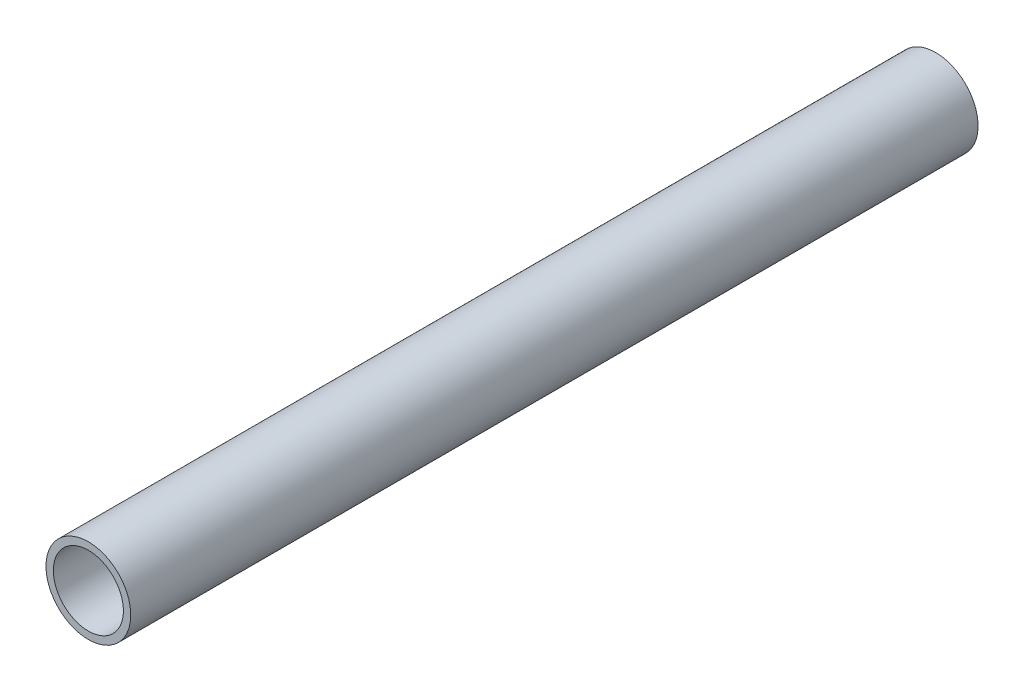
ISO-10303-21;
HEADER;
FILE_DESCRIPTION(('STEP AP214'),'2;1');
FILE_NAME('part.step','',(''),(''),'','','');
FILE_SCHEMA(('AUTOMOTIVE_DESIGN { 1 0 10303 214 1 1 1 1 }'));
ENDSEC;
DATA;
#1=APPLICATION_CONTEXT('core data for automotive mechanical design processes');
#2=APPLICATION_PROTOCOL_DEFINITION('international standard','automotive_design',2000,#1);
#3=PRODUCT_CONTEXT('',#1,'mechanical');
#4=PRODUCT('Part','Part','',(#3));
#5=PRODUCT_RELATED_PRODUCT_CATEGORY('part','',(#4));
#6=PRODUCT_DEFINITION_FORMATION('','',#4);
#7=PRODUCT_DEFINITION_CONTEXT('part definition',#1,'design');
#8=PRODUCT_DEFINITION('design','',#6,#7);
#9=PRODUCT_DEFINITION_SHAPE('','',#8);
#10=(LENGTH_UNIT() NAMED_UNIT(*) SI_UNIT(.MILLI.,.METRE.));
#11=(NAMED_UNIT(*) PLANE_ANGLE_UNIT() SI_UNIT($,.RADIAN.));
#12=(NAMED_UNIT(*) SI_UNIT($,.STERADIAN.) SOLID_ANGLE_UNIT());
#13=UNCERTAINTY_MEASURE_WITH_UNIT(LENGTH_MEASURE(1.E-05),#10,'distance_accuracy_value','');
#14=(GEOMETRIC_REPRESENTATION_CONTEXT(3) GLOBAL_UNCERTAINTY_ASSIGNED_CONTEXT((#13)) GLOBAL_UNIT_ASSIGNED_CONTEXT((#10,
#11,#12)) REPRESENTATION_CONTEXT('',''));
#15=CARTESIAN_POINT('',(0.,0.,0.));
#16=DIRECTION('',(0.,0.,1.));
#17=DIRECTION('',(1.,0.,0.));
#18=AXIS2_PLACEMENT_3D('',#15,#16,#17);
#19=CARTESIAN_POINT('',(0.,9.52499999999999,95.25));
#20=DIRECTION('',(0.,0.,1.));
#21=DIRECTION('',(1.,0.,0.));
#22=AXIS2_PLACEMENT_3D('',#19,#20,#21);
#23=PLANE('',#22);
#24=CARTESIAN_POINT('',(0.,0.,95.25));
#25=DIRECTION('',(0.,0.,-1.));
#26=DIRECTION('',(-1.,0.,0.));
#27=AXIS2_PLACEMENT_3D('',#24,#25,#26);
#28=CIRCLE('',#27,7.87399999999999);
#29=CARTESIAN_POINT('',(-7.87399999999999,0.,95.25));
#30=VERTEX_POINT('',#29);
#31=EDGE_CURVE('E10',#30,#30,#28,.T.);
#32=ORIENTED_EDGE('',*,*,#31,.T.);
#33=EDGE_LOOP('',(#32));
#34=FACE_BOUND('',#33,.T.);
#35=CARTESIAN_POINT('',(0.,0.,95.25));
#36=DIRECTION('',(0.,0.,-1.));
#37=DIRECTION('',(-1.,0.,0.));
#38=AXIS2_PLACEMENT_3D('',#35,#36,#37);
#39=CIRCLE('',#38,9.52499999999999);
#40=CARTESIAN_POINT('',(-9.52499999999999,0.,95.25));
#41=VERTEX_POINT('',#40);
#42=EDGE_CURVE('E45',#41,#41,#39,.T.);
#43=ORIENTED_EDGE('',*,*,#42,.F.);
#44=EDGE_LOOP('',(#43));
#45=FACE_BOUND('',#44,.T.);
#46=ADVANCED_FACE('F31',(#34,#45),#23,.T.);
#47=CARTESIAN_POINT('',(0.,0.,0.));
#48=DIRECTION('',(0.,0.,-1.));
#49=DIRECTION('',(-1.,0.,0.));
#50=AXIS2_PLACEMENT_3D('',#47,#48,#49);
#51=CYLINDRICAL_SURFACE('',#50,7.87399999999999);
#52=CARTESIAN_POINT('',(0.,0.,-95.25));
#53=DIRECTION('',(0.,0.,-1.));
#54=DIRECTION('',(-1.,0.,0.));
#55=AXIS2_PLACEMENT_3D('',#52,#53,#54);
#56=CIRCLE('',#55,7.87399999999999);
#57=CARTESIAN_POINT('',(-7.87399999999999,0.,-95.25));
#58=VERTEX_POINT('',#57);
#59=EDGE_CURVE('E37',#58,#58,#56,.T.);
#60=ORIENTED_EDGE('',*,*,#59,.T.);
#61=EDGE_LOOP('',(#60));
#62=FACE_BOUND('',#61,.T.);
#63=ORIENTED_EDGE('',*,*,#31,.F.);
#64=EDGE_LOOP('',(#63));
#65=FACE_BOUND('',#64,.T.);
#66=ADVANCED_FACE('F55',(#62,#65),#51,.F.);
#67=CARTESIAN_POINT('',(0.,7.87399999999999,-95.25));
#68=DIRECTION('',(0.,0.,-1.));
#69=DIRECTION('',(-1.,0.,0.));
#70=AXIS2_PLACEMENT_3D('',#67,#68,#69);
#71=PLANE('',#70);
#72=CARTESIAN_POINT('',(0.,0.,-95.25));
#73=DIRECTION('',(0.,0.,-1.));
#74=DIRECTION('',(-1.,0.,0.));
#75=AXIS2_PLACEMENT_3D('',#72,#73,#74);
#76=CIRCLE('',#75,9.52499999999999);
#77=CARTESIAN_POINT('',(-9.52499999999999,0.,-95.25));
#78=VERTEX_POINT('',#77);
#79=EDGE_CURVE('E41',#78,#78,#76,.T.);
#80=ORIENTED_EDGE('',*,*,#79,.T.);
#81=EDGE_LOOP('',(#80));
#82=FACE_BOUND('',#81,.T.);
#83=ORIENTED_EDGE('',*,*,#59,.F.);
#84=EDGE_LOOP('',(#83));
#85=FACE_BOUND('',#84,.T.);
#86=ADVANCED_FACE('F59',(#82,#85),#71,.T.);
#87=CARTESIAN_POINT('',(0.,0.,0.));
#88=DIRECTION('',(0.,0.,-1.));
#89=DIRECTION('',(-1.,0.,0.));
#90=AXIS2_PLACEMENT_3D('',#87,#88,#89);
#91=CYLINDRICAL_SURFACE('',#90,9.52499999999999);
#92=ORIENTED_EDGE('',*,*,#42,.T.);
#93=EDGE_LOOP('',(#92));
#94=FACE_BOUND('',#93,.T.);
#95=ORIENTED_EDGE('',*,*,#79,.F.);
#96=EDGE_LOOP('',(#95));
#97=FACE_BOUND('',#96,.T.);
#98=ADVANCED_FACE('F51',(#94,#97),#91,.T.);
#99=CLOSED_SHELL('',(#46,#66,#86,#98));
#100=MANIFOLD_SOLID_BREP('B2',#99);
#101=ADVANCED_BREP_SHAPE_REPRESENTATION('',(#18,#100),#14);
#102=SHAPE_DEFINITION_REPRESENTATION(#9,#101);
ENDSEC;
END-ISO-10303-21;
